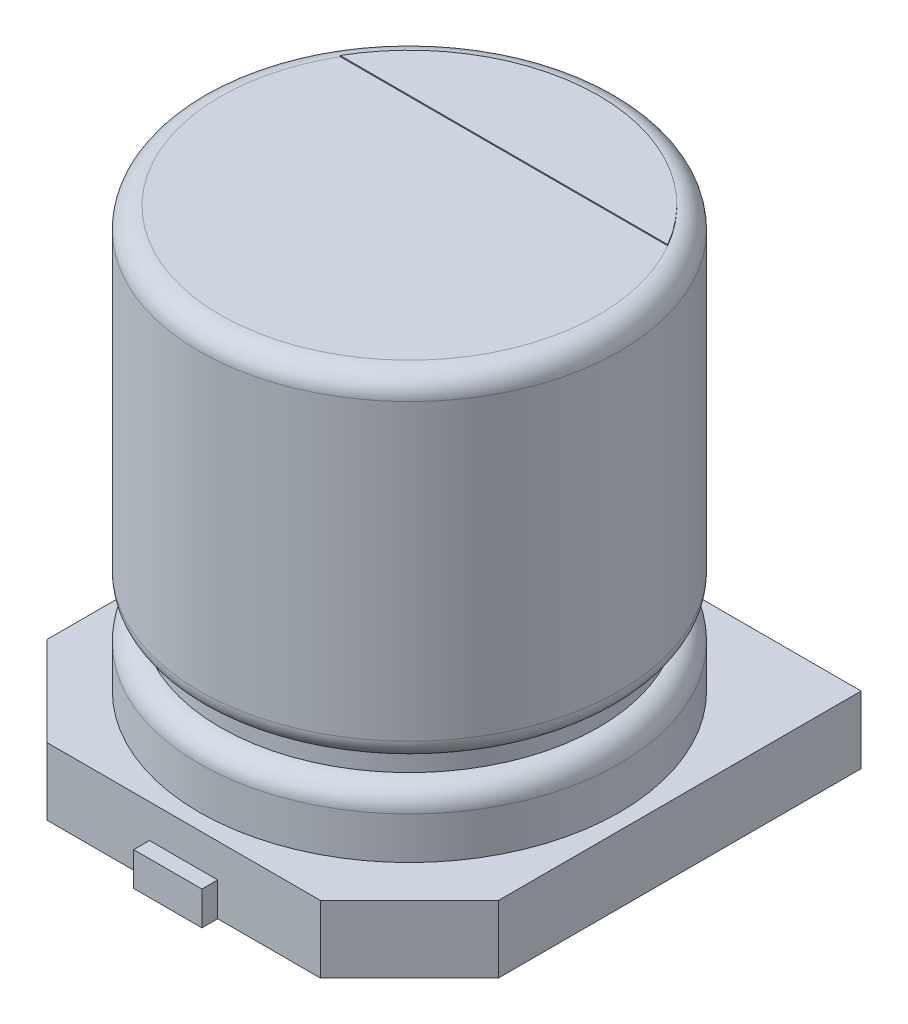
ISO-10303-21;
HEADER;
FILE_DESCRIPTION(('STEP AP214'),'2;1');
FILE_NAME('part.step','',(''),(''),'','','');
FILE_SCHEMA(('AUTOMOTIVE_DESIGN { 1 0 10303 214 1 1 1 1 }'));
ENDSEC;
DATA;
#1=APPLICATION_CONTEXT('core data for automotive mechanical design processes');
#2=APPLICATION_PROTOCOL_DEFINITION('international standard','automotive_design',2000,#1);
#3=PRODUCT_CONTEXT('',#1,'mechanical');
#4=PRODUCT('Part','Part','',(#3));
#5=PRODUCT_RELATED_PRODUCT_CATEGORY('part','',(#4));
#6=PRODUCT_DEFINITION_FORMATION('','',#4);
#7=PRODUCT_DEFINITION_CONTEXT('part definition',#1,'design');
#8=PRODUCT_DEFINITION('design','',#6,#7);
#9=PRODUCT_DEFINITION_SHAPE('','',#8);
#10=(LENGTH_UNIT() NAMED_UNIT(*) SI_UNIT(.MILLI.,.METRE.));
#11=(NAMED_UNIT(*) PLANE_ANGLE_UNIT() SI_UNIT($,.RADIAN.));
#12=(NAMED_UNIT(*) SI_UNIT($,.STERADIAN.) SOLID_ANGLE_UNIT());
#13=UNCERTAINTY_MEASURE_WITH_UNIT(LENGTH_MEASURE(1.E-05),#10,'distance_accuracy_value','');
#14=(GEOMETRIC_REPRESENTATION_CONTEXT(3) GLOBAL_UNCERTAINTY_ASSIGNED_CONTEXT((#13)) GLOBAL_UNIT_ASSIGNED_CONTEXT((#10,
#11,#12)) REPRESENTATION_CONTEXT('',''));
#15=CARTESIAN_POINT('',(0.,0.,0.));
#16=DIRECTION('',(0.,0.,1.));
#17=DIRECTION('',(1.,0.,0.));
#18=AXIS2_PLACEMENT_3D('',#15,#16,#17);
#19=CARTESIAN_POINT('',(0.,-0.64,0.));
#20=DIRECTION('',(0.,-1.,0.));
#21=DIRECTION('',(1.,0.,0.));
#22=AXIS2_PLACEMENT_3D('',#19,#20,#21);
#23=PLANE('',#22);
#24=DIRECTION('',(-1.,0.,0.));
#25=VECTOR('',#24,1.);
#26=CARTESIAN_POINT('',(1.30147186257614,-0.64,2.15));
#27=LINE('',#26,#25);
#28=CARTESIAN_POINT('',(1.30147186257614,-0.64,2.15));
#29=VERTEX_POINT('',#28);
#30=CARTESIAN_POINT('',(0.325,-0.64,2.15));
#31=VERTEX_POINT('',#30);
#32=EDGE_CURVE('E238',#29,#31,#27,.T.);
#33=ORIENTED_EDGE('',*,*,#32,.T.);
#34=DIRECTION('',(0.,0.,-1.));
#35=VECTOR('',#34,1.);
#36=CARTESIAN_POINT('',(0.325,-0.64,0.));
#37=LINE('',#36,#35);
#38=CARTESIAN_POINT('',(0.325,-0.64,0.5));
#39=VERTEX_POINT('',#38);
#40=EDGE_CURVE('E11',#31,#39,#37,.T.);
#41=ORIENTED_EDGE('',*,*,#40,.T.);
#42=DIRECTION('',(-1.,0.,0.));
#43=VECTOR('',#42,1.);
#44=CARTESIAN_POINT('',(0.,-0.64,0.5));
#45=LINE('',#44,#43);
#46=CARTESIAN_POINT('',(-0.325,-0.64,0.5));
#47=VERTEX_POINT('',#46);
#48=EDGE_CURVE('E45',#39,#47,#45,.T.);
#49=ORIENTED_EDGE('',*,*,#48,.T.);
#50=DIRECTION('',(0.,0.,1.));
#51=VECTOR('',#50,1.);
#52=CARTESIAN_POINT('',(-0.325,-0.64,0.));
#53=LINE('',#52,#51);
#54=CARTESIAN_POINT('',(-0.325,-0.64,2.15));
#55=VERTEX_POINT('',#54);
#56=EDGE_CURVE('E317',#47,#55,#53,.T.);
#57=ORIENTED_EDGE('',*,*,#56,.T.);
#58=CARTESIAN_POINT('',(-1.30147186257614,-0.64,2.15));
#59=VERTEX_POINT('',#58);
#60=EDGE_CURVE('E237',#55,#59,#27,.T.);
#61=ORIENTED_EDGE('',*,*,#60,.T.);
#62=DIRECTION('',(-0.707106781186546,0.,-0.707106781186549));
#63=VECTOR('',#62,1.);
#64=CARTESIAN_POINT('',(-1.30147186257614,-0.64,2.15));
#65=LINE('',#64,#63);
#66=CARTESIAN_POINT('',(-2.15,-0.64,1.30147186257614));
#67=VERTEX_POINT('',#66);
#68=EDGE_CURVE('E240',#59,#67,#65,.T.);
#69=ORIENTED_EDGE('',*,*,#68,.T.);
#70=DIRECTION('',(0.,0.,-1.));
#71=VECTOR('',#70,1.);
#72=CARTESIAN_POINT('',(-2.15,-0.64,1.30147186257614));
#73=LINE('',#72,#71);
#74=CARTESIAN_POINT('',(-2.15,-0.64,-2.15));
#75=VERTEX_POINT('',#74);
#76=EDGE_CURVE('E225',#67,#75,#73,.T.);
#77=ORIENTED_EDGE('',*,*,#76,.T.);
#78=DIRECTION('',(1.,0.,0.));
#79=VECTOR('',#78,1.);
#80=CARTESIAN_POINT('',(-2.15,-0.64,-2.15));
#81=LINE('',#80,#79);
#82=CARTESIAN_POINT('',(-0.325,-0.64,-2.15));
#83=VERTEX_POINT('',#82);
#84=EDGE_CURVE('E230',#75,#83,#81,.T.);
#85=ORIENTED_EDGE('',*,*,#84,.T.);
#86=DIRECTION('',(0.,0.,1.));
#87=VECTOR('',#86,1.);
#88=CARTESIAN_POINT('',(-0.325,-0.64,0.));
#89=LINE('',#88,#87);
#90=CARTESIAN_POINT('',(-0.325,-0.64,-0.5));
#91=VERTEX_POINT('',#90);
#92=EDGE_CURVE('E314',#83,#91,#89,.T.);
#93=ORIENTED_EDGE('',*,*,#92,.T.);
#94=DIRECTION('',(1.,0.,0.));
#95=VECTOR('',#94,1.);
#96=CARTESIAN_POINT('',(0.,-0.64,-0.5));
#97=LINE('',#96,#95);
#98=CARTESIAN_POINT('',(0.325,-0.64,-0.5));
#99=VERTEX_POINT('',#98);
#100=EDGE_CURVE('E307',#91,#99,#97,.T.);
#101=ORIENTED_EDGE('',*,*,#100,.T.);
#102=DIRECTION('',(0.,0.,-1.));
#103=VECTOR('',#102,1.);
#104=CARTESIAN_POINT('',(0.325,-0.64,0.));
#105=LINE('',#104,#103);
#106=CARTESIAN_POINT('',(0.325,-0.64,-2.15));
#107=VERTEX_POINT('',#106);
#108=EDGE_CURVE('E311',#99,#107,#105,.T.);
#109=ORIENTED_EDGE('',*,*,#108,.T.);
#110=CARTESIAN_POINT('',(2.15,-0.64,-2.15));
#111=VERTEX_POINT('',#110);
#112=EDGE_CURVE('E228',#107,#111,#81,.T.);
#113=ORIENTED_EDGE('',*,*,#112,.T.);
#114=DIRECTION('',(0.,0.,1.));
#115=VECTOR('',#114,1.);
#116=CARTESIAN_POINT('',(2.15,-0.64,-2.15));
#117=LINE('',#116,#115);
#118=CARTESIAN_POINT('',(2.15,-0.64,1.30147186257614));
#119=VERTEX_POINT('',#118);
#120=EDGE_CURVE('E233',#111,#119,#117,.T.);
#121=ORIENTED_EDGE('',*,*,#120,.T.);
#122=DIRECTION('',(-0.707106781186546,0.,0.707106781186549));
#123=VECTOR('',#122,1.);
#124=CARTESIAN_POINT('',(2.15,-0.64,1.30147186257614));
#125=LINE('',#124,#123);
#126=EDGE_CURVE('E235',#119,#29,#125,.T.);
#127=ORIENTED_EDGE('',*,*,#126,.T.);
#128=EDGE_LOOP('',(#33,#41,#49,#57,#61,#69,#77,#85,#93,#101,#109,#113,#121,#127));
#129=FACE_BOUND('',#128,.T.);
#130=ADVANCED_FACE('F36',(#129),#23,.T.);
#131=ORIENTED_EDGE('',*,*,#40,.F.);
#132=DIRECTION('',(0.,0.,1.));
#133=VECTOR('',#132,1.);
#134=CARTESIAN_POINT('',(0.325,-0.64,0.5));
#135=LINE('',#134,#133);
#136=CARTESIAN_POINT('',(0.325,-0.64,2.3));
#137=VERTEX_POINT('',#136);
#138=EDGE_CURVE('E156',#31,#137,#135,.T.);
#139=ORIENTED_EDGE('',*,*,#138,.T.);
#140=DIRECTION('',(-1.,0.,0.));
#141=VECTOR('',#140,1.);
#142=CARTESIAN_POINT('',(-0.325,-0.64,2.3));
#143=LINE('',#142,#141);
#144=CARTESIAN_POINT('',(-0.325,-0.64,2.3));
#145=VERTEX_POINT('',#144);
#146=EDGE_CURVE('E161',#137,#145,#143,.T.);
#147=ORIENTED_EDGE('',*,*,#146,.T.);
#148=DIRECTION('',(0.,0.,-1.));
#149=VECTOR('',#148,1.);
#150=CARTESIAN_POINT('',(-0.325,-0.64,0.5));
#151=LINE('',#150,#149);
#152=EDGE_CURVE('E180',#145,#55,#151,.T.);
#153=ORIENTED_EDGE('',*,*,#152,.T.);
#154=ORIENTED_EDGE('',*,*,#56,.F.);
#155=ORIENTED_EDGE('',*,*,#48,.F.);
#156=EDGE_LOOP('',(#131,#139,#147,#153,#154,#155));
#157=FACE_BOUND('',#156,.T.);
#158=ADVANCED_FACE('F158',(#157),#23,.T.);
#159=ORIENTED_EDGE('',*,*,#92,.F.);
#160=DIRECTION('',(0.,0.,-1.));
#161=VECTOR('',#160,1.);
#162=CARTESIAN_POINT('',(-0.325,-0.64,-0.5));
#163=LINE('',#162,#161);
#164=CARTESIAN_POINT('',(-0.325,-0.64,-2.3));
#165=VERTEX_POINT('',#164);
#166=EDGE_CURVE('E190',#83,#165,#163,.T.);
#167=ORIENTED_EDGE('',*,*,#166,.T.);
#168=DIRECTION('',(1.,0.,0.));
#169=VECTOR('',#168,1.);
#170=CARTESIAN_POINT('',(-0.325,-0.64,-2.3));
#171=LINE('',#170,#169);
#172=CARTESIAN_POINT('',(0.325,-0.64,-2.3));
#173=VERTEX_POINT('',#172);
#174=EDGE_CURVE('E192',#165,#173,#171,.T.);
#175=ORIENTED_EDGE('',*,*,#174,.T.);
#176=DIRECTION('',(0.,0.,1.));
#177=VECTOR('',#176,1.);
#178=CARTESIAN_POINT('',(0.325,-0.64,-0.5));
#179=LINE('',#178,#177);
#180=EDGE_CURVE('E195',#173,#107,#179,.T.);
#181=ORIENTED_EDGE('',*,*,#180,.T.);
#182=ORIENTED_EDGE('',*,*,#108,.F.);
#183=ORIENTED_EDGE('',*,*,#100,.F.);
#184=EDGE_LOOP('',(#159,#167,#175,#181,#182,#183));
#185=FACE_BOUND('',#184,.T.);
#186=ADVANCED_FACE('F372',(#185),#23,.T.);
#187=CARTESIAN_POINT('',(1.30147186257614,-0.64,2.15));
#188=DIRECTION('',(0.,0.,-1.));
#189=DIRECTION('',(-1.,0.,0.));
#190=AXIS2_PLACEMENT_3D('',#187,#188,#189);
#191=PLANE('',#190);
#192=DIRECTION('',(0.,-1.,0.));
#193=VECTOR('',#192,1.);
#194=CARTESIAN_POINT('',(-0.324999999999999,-0.32,2.15));
#195=LINE('',#194,#193);
#196=CARTESIAN_POINT('',(-0.325,-0.32,2.15));
#197=VERTEX_POINT('',#196);
#198=EDGE_CURVE('E212',#197,#55,#195,.T.);
#199=ORIENTED_EDGE('',*,*,#198,.F.);
#200=DIRECTION('',(-1.,0.,0.));
#201=VECTOR('',#200,1.);
#202=CARTESIAN_POINT('',(0.,-0.32,2.15));
#203=LINE('',#202,#201);
#204=CARTESIAN_POINT('',(0.325,-0.32,2.15));
#205=VERTEX_POINT('',#204);
#206=EDGE_CURVE('E209',#205,#197,#203,.T.);
#207=ORIENTED_EDGE('',*,*,#206,.F.);
#208=DIRECTION('',(0.,-1.,0.));
#209=VECTOR('',#208,1.);
#210=CARTESIAN_POINT('',(0.324999999999999,-0.32,2.15));
#211=LINE('',#210,#209);
#212=EDGE_CURVE('E211',#205,#31,#211,.T.);
#213=ORIENTED_EDGE('',*,*,#212,.T.);
#214=ORIENTED_EDGE('',*,*,#32,.F.);
#215=DIRECTION('',(0.,1.,0.));
#216=VECTOR('',#215,1.);
#217=CARTESIAN_POINT('',(1.30147186257614,-0.64,2.15));
#218=LINE('',#217,#216);
#219=CARTESIAN_POINT('',(1.30147186257614,0.,2.15));
#220=VERTEX_POINT('',#219);
#221=EDGE_CURVE('E259',#29,#220,#218,.T.);
#222=ORIENTED_EDGE('',*,*,#221,.T.);
#223=DIRECTION('',(-1.,0.,0.));
#224=VECTOR('',#223,1.);
#225=CARTESIAN_POINT('',(1.30147186257614,0.,2.15));
#226=LINE('',#225,#224);
#227=CARTESIAN_POINT('',(-1.30147186257614,0.,2.15));
#228=VERTEX_POINT('',#227);
#229=EDGE_CURVE('E251',#220,#228,#226,.T.);
#230=ORIENTED_EDGE('',*,*,#229,.T.);
#231=DIRECTION('',(0.,1.,0.));
#232=VECTOR('',#231,1.);
#233=CARTESIAN_POINT('',(-1.30147186257614,-0.64,2.15));
#234=LINE('',#233,#232);
#235=EDGE_CURVE('E256',#59,#228,#234,.T.);
#236=ORIENTED_EDGE('',*,*,#235,.F.);
#237=ORIENTED_EDGE('',*,*,#60,.F.);
#238=EDGE_LOOP('',(#199,#207,#213,#214,#222,#230,#236,#237));
#239=FACE_BOUND('',#238,.T.);
#240=ADVANCED_FACE('F340',(#239),#191,.F.);
#241=CARTESIAN_POINT('',(-2.15,-0.64,-2.15));
#242=DIRECTION('',(0.,0.,1.));
#243=DIRECTION('',(1.,0.,0.));
#244=AXIS2_PLACEMENT_3D('',#241,#242,#243);
#245=PLANE('',#244);
#246=DIRECTION('',(0.,-1.,0.));
#247=VECTOR('',#246,1.);
#248=CARTESIAN_POINT('',(0.324999999999999,-0.32,-2.15));
#249=LINE('',#248,#247);
#250=CARTESIAN_POINT('',(0.325,-0.32,-2.15));
#251=VERTEX_POINT('',#250);
#252=EDGE_CURVE('E219',#251,#107,#249,.T.);
#253=ORIENTED_EDGE('',*,*,#252,.F.);
#254=DIRECTION('',(1.,0.,0.));
#255=VECTOR('',#254,1.);
#256=CARTESIAN_POINT('',(0.,-0.32,-2.15));
#257=LINE('',#256,#255);
#258=CARTESIAN_POINT('',(-0.325,-0.32,-2.15));
#259=VERTEX_POINT('',#258);
#260=EDGE_CURVE('E215',#259,#251,#257,.T.);
#261=ORIENTED_EDGE('',*,*,#260,.F.);
#262=DIRECTION('',(0.,-1.,0.));
#263=VECTOR('',#262,1.);
#264=CARTESIAN_POINT('',(-0.324999999999999,-0.32,-2.15));
#265=LINE('',#264,#263);
#266=EDGE_CURVE('E218',#259,#83,#265,.T.);
#267=ORIENTED_EDGE('',*,*,#266,.T.);
#268=ORIENTED_EDGE('',*,*,#84,.F.);
#269=DIRECTION('',(0.,1.,0.));
#270=VECTOR('',#269,1.);
#271=CARTESIAN_POINT('',(-2.15,-0.64,-2.15));
#272=LINE('',#271,#270);
#273=CARTESIAN_POINT('',(-2.15,0.,-2.15));
#274=VERTEX_POINT('',#273);
#275=EDGE_CURVE('E268',#75,#274,#272,.T.);
#276=ORIENTED_EDGE('',*,*,#275,.T.);
#277=DIRECTION('',(1.,0.,0.));
#278=VECTOR('',#277,1.);
#279=CARTESIAN_POINT('',(-2.15,0.,-2.15));
#280=LINE('',#279,#278);
#281=CARTESIAN_POINT('',(2.15,0.,-2.15));
#282=VERTEX_POINT('',#281);
#283=EDGE_CURVE('E245',#274,#282,#280,.T.);
#284=ORIENTED_EDGE('',*,*,#283,.T.);
#285=DIRECTION('',(0.,1.,0.));
#286=VECTOR('',#285,1.);
#287=CARTESIAN_POINT('',(2.15,-0.64,-2.15));
#288=LINE('',#287,#286);
#289=EDGE_CURVE('E265',#111,#282,#288,.T.);
#290=ORIENTED_EDGE('',*,*,#289,.F.);
#291=ORIENTED_EDGE('',*,*,#112,.F.);
#292=EDGE_LOOP('',(#253,#261,#267,#268,#276,#284,#290,#291));
#293=FACE_BOUND('',#292,.T.);
#294=ADVANCED_FACE('F354',(#293),#245,.F.);
#295=CARTESIAN_POINT('',(0.,4.,0.));
#296=DIRECTION('',(0.,1.,0.));
#297=DIRECTION('',(-1.,0.,0.));
#298=AXIS2_PLACEMENT_3D('',#295,#296,#297);
#299=PLANE('',#298);
#300=CARTESIAN_POINT('',(0.,4.,0.));
#301=DIRECTION('',(0.,1.,0.));
#302=DIRECTION('',(-1.,0.,0.));
#303=AXIS2_PLACEMENT_3D('',#300,#301,#302);
#304=CIRCLE('',#303,1.8);
#305=CARTESIAN_POINT('',(-1.55884572681199,4.,-0.899999999999999));
#306=VERTEX_POINT('',#305);
#307=CARTESIAN_POINT('',(1.55884572681199,4.,-0.899999999999999));
#308=VERTEX_POINT('',#307);
#309=EDGE_CURVE('E303',#306,#308,#304,.T.);
#310=ORIENTED_EDGE('',*,*,#309,.T.);
#311=DIRECTION('',(1.,0.,0.));
#312=VECTOR('',#311,1.);
#313=CARTESIAN_POINT('',(-1.55884572681199,4.,-0.899999999999999));
#314=LINE('',#313,#312);
#315=EDGE_CURVE('E274',#306,#308,#314,.T.);
#316=ORIENTED_EDGE('',*,*,#315,.F.);
#317=EDGE_LOOP('',(#310,#316));
#318=FACE_BOUND('',#317,.T.);
#319=ADVANCED_FACE('F38',(#318),#299,.T.);
#320=CARTESIAN_POINT('',(0.,3.8,0.));
#321=DIRECTION('',(0.,1.,0.));
#322=DIRECTION('',(-1.,0.,0.));
#323=AXIS2_PLACEMENT_3D('',#320,#321,#322);
#324=TOROIDAL_SURFACE('',#323,1.8,0.2);
#325=CARTESIAN_POINT('',(0.,3.8,0.));
#326=DIRECTION('',(0.,1.,0.));
#327=DIRECTION('',(-1.,0.,0.));
#328=AXIS2_PLACEMENT_3D('',#325,#326,#327);
#329=CIRCLE('',#328,2.);
#330=CARTESIAN_POINT('',(-2.,3.8,0.));
#331=VERTEX_POINT('',#330);
#332=EDGE_CURVE('E300',#331,#331,#329,.T.);
#333=ORIENTED_EDGE('',*,*,#332,.T.);
#334=EDGE_LOOP('',(#333));
#335=FACE_BOUND('',#334,.T.);
#336=EDGE_CURVE('E304',#308,#306,#304,.T.);
#337=ORIENTED_EDGE('',*,*,#336,.F.);
#338=ORIENTED_EDGE('',*,*,#309,.F.);
#339=EDGE_LOOP('',(#337,#338));
#340=FACE_BOUND('',#339,.T.);
#341=ADVANCED_FACE('F453',(#335,#340),#324,.T.);
#342=CARTESIAN_POINT('',(0.,8.08222988146831,0.));
#343=DIRECTION('',(0.,1.,0.));
#344=DIRECTION('',(-1.,0.,0.));
#345=AXIS2_PLACEMENT_3D('',#342,#343,#344);
#346=CYLINDRICAL_SURFACE('',#345,2.);
#347=CARTESIAN_POINT('',(0.,0.999999999999999,0.));
#348=DIRECTION('',(0.,1.,0.));
#349=DIRECTION('',(-1.,0.,0.));
#350=AXIS2_PLACEMENT_3D('',#347,#348,#349);
#351=CIRCLE('',#350,2.);
#352=CARTESIAN_POINT('',(-2.,0.999999999999999,0.));
#353=VERTEX_POINT('',#352);
#354=EDGE_CURVE('E297',#353,#353,#351,.T.);
#355=ORIENTED_EDGE('',*,*,#354,.T.);
#356=EDGE_LOOP('',(#355));
#357=FACE_BOUND('',#356,.T.);
#358=ORIENTED_EDGE('',*,*,#332,.F.);
#359=EDGE_LOOP('',(#358));
#360=FACE_BOUND('',#359,.T.);
#361=ADVANCED_FACE('F450',(#357,#360),#346,.T.);
#362=CARTESIAN_POINT('',(0.,1.,0.));
#363=DIRECTION('',(0.,1.,0.));
#364=DIRECTION('',(-1.,0.,0.));
#365=AXIS2_PLACEMENT_3D('',#362,#363,#364);
#366=TOROIDAL_SURFACE('',#365,1.8,0.2);
#367=CARTESIAN_POINT('',(0.,0.799999999999999,0.));
#368=DIRECTION('',(0.,1.,0.));
#369=DIRECTION('',(-1.,0.,0.));
#370=AXIS2_PLACEMENT_3D('',#367,#368,#369);
#371=CIRCLE('',#370,1.8);
#372=CARTESIAN_POINT('',(-1.8,0.799999999999999,0.));
#373=VERTEX_POINT('',#372);
#374=EDGE_CURVE('E294',#373,#373,#371,.T.);
#375=ORIENTED_EDGE('',*,*,#374,.T.);
#376=EDGE_LOOP('',(#375));
#377=FACE_BOUND('',#376,.T.);
#378=ORIENTED_EDGE('',*,*,#354,.F.);
#379=EDGE_LOOP('',(#378));
#380=FACE_BOUND('',#379,.T.);
#381=ADVANCED_FACE('F446',(#377,#380),#366,.T.);
#382=CARTESIAN_POINT('',(0.,8.08222988146831,0.));
#383=DIRECTION('',(0.,1.,0.));
#384=DIRECTION('',(-1.,0.,0.));
#385=AXIS2_PLACEMENT_3D('',#382,#383,#384);
#386=CYLINDRICAL_SURFACE('',#385,1.8);
#387=CARTESIAN_POINT('',(0.,0.6,0.));
#388=DIRECTION('',(0.,1.,0.));
#389=DIRECTION('',(-1.,0.,0.));
#390=AXIS2_PLACEMENT_3D('',#387,#388,#389);
#391=CIRCLE('',#390,1.8);
#392=CARTESIAN_POINT('',(-1.8,0.6,0.));
#393=VERTEX_POINT('',#392);
#394=EDGE_CURVE('E291',#393,#393,#391,.T.);
#395=ORIENTED_EDGE('',*,*,#394,.T.);
#396=EDGE_LOOP('',(#395));
#397=FACE_BOUND('',#396,.T.);
#398=ORIENTED_EDGE('',*,*,#374,.F.);
#399=EDGE_LOOP('',(#398));
#400=FACE_BOUND('',#399,.T.);
#401=ADVANCED_FACE('F442',(#397,#400),#386,.T.);
#402=CARTESIAN_POINT('',(0.,0.4,0.));
#403=DIRECTION('',(0.,1.,0.));
#404=DIRECTION('',(-1.,0.,0.));
#405=AXIS2_PLACEMENT_3D('',#402,#403,#404);
#406=TOROIDAL_SURFACE('',#405,1.8,0.2);
#407=CARTESIAN_POINT('',(0.,0.399999999999999,0.));
#408=DIRECTION('',(0.,1.,0.));
#409=DIRECTION('',(-1.,0.,0.));
#410=AXIS2_PLACEMENT_3D('',#407,#408,#409);
#411=CIRCLE('',#410,2.);
#412=CARTESIAN_POINT('',(-2.,0.399999999999999,0.));
#413=VERTEX_POINT('',#412);
#414=EDGE_CURVE('E288',#413,#413,#411,.T.);
#415=ORIENTED_EDGE('',*,*,#414,.T.);
#416=EDGE_LOOP('',(#415));
#417=FACE_BOUND('',#416,.T.);
#418=ORIENTED_EDGE('',*,*,#394,.F.);
#419=EDGE_LOOP('',(#418));
#420=FACE_BOUND('',#419,.T.);
#421=ADVANCED_FACE('F438',(#417,#420),#406,.T.);
#422=CARTESIAN_POINT('',(0.,8.08222988146831,0.));
#423=DIRECTION('',(0.,1.,0.));
#424=DIRECTION('',(-1.,0.,0.));
#425=AXIS2_PLACEMENT_3D('',#422,#423,#424);
#426=CYLINDRICAL_SURFACE('',#425,2.);
#427=CARTESIAN_POINT('',(0.,0.,0.));
#428=DIRECTION('',(0.,-1.,0.));
#429=DIRECTION('',(1.,0.,0.));
#430=AXIS2_PLACEMENT_3D('',#427,#428,#429);
#431=CIRCLE('',#430,2.);
#432=CARTESIAN_POINT('',(2.,0.,0.));
#433=VERTEX_POINT('',#432);
#434=EDGE_CURVE('E271',#433,#433,#431,.F.);
#435=ORIENTED_EDGE('',*,*,#434,.T.);
#436=EDGE_LOOP('',(#435));
#437=FACE_BOUND('',#436,.T.);
#438=ORIENTED_EDGE('',*,*,#414,.F.);
#439=EDGE_LOOP('',(#438));
#440=FACE_BOUND('',#439,.T.);
#441=ADVANCED_FACE('F434',(#437,#440),#426,.T.);
#442=CARTESIAN_POINT('',(0.,4.01,0.));
#443=DIRECTION('',(0.,-1.,0.));
#444=DIRECTION('',(1.,0.,0.));
#445=AXIS2_PLACEMENT_3D('',#442,#443,#444);
#446=CYLINDRICAL_SURFACE('',#445,1.8);
#447=ORIENTED_EDGE('',*,*,#336,.T.);
#448=DIRECTION('',(0.,-1.,0.));
#449=VECTOR('',#448,1.);
#450=CARTESIAN_POINT('',(-1.55884572681199,4.01,-0.899999999999999));
#451=LINE('',#450,#449);
#452=CARTESIAN_POINT('',(-1.55884572681199,4.01,-0.899999999999999));
#453=VERTEX_POINT('',#452);
#454=EDGE_CURVE('E285',#453,#306,#451,.T.);
#455=ORIENTED_EDGE('',*,*,#454,.F.);
#456=CARTESIAN_POINT('',(0.,4.01,0.));
#457=DIRECTION('',(0.,1.,0.));
#458=DIRECTION('',(-1.,0.,0.));
#459=AXIS2_PLACEMENT_3D('',#456,#457,#458);
#460=CIRCLE('',#459,1.8);
#461=CARTESIAN_POINT('',(1.55884572681199,4.01,-0.899999999999999));
#462=VERTEX_POINT('',#461);
#463=EDGE_CURVE('E275',#462,#453,#460,.T.);
#464=ORIENTED_EDGE('',*,*,#463,.F.);
#465=DIRECTION('',(0.,-1.,0.));
#466=VECTOR('',#465,1.);
#467=CARTESIAN_POINT('',(1.55884572681199,4.01,-0.899999999999999));
#468=LINE('',#467,#466);
#469=EDGE_CURVE('E280',#462,#308,#468,.T.);
#470=ORIENTED_EDGE('',*,*,#469,.T.);
#471=EDGE_LOOP('',(#447,#455,#464,#470));
#472=FACE_BOUND('',#471,.T.);
#473=ADVANCED_FACE('F430',(#472),#446,.T.);
#474=CARTESIAN_POINT('',(-1.55884572681199,4.01,-0.899999999999999));
#475=DIRECTION('',(0.,0.,-1.));
#476=DIRECTION('',(-1.,0.,0.));
#477=AXIS2_PLACEMENT_3D('',#474,#475,#476);
#478=PLANE('',#477);
#479=ORIENTED_EDGE('',*,*,#315,.T.);
#480=ORIENTED_EDGE('',*,*,#469,.F.);
#481=DIRECTION('',(1.,0.,0.));
#482=VECTOR('',#481,1.);
#483=CARTESIAN_POINT('',(-1.55884572681199,4.01,-0.899999999999999));
#484=LINE('',#483,#482);
#485=EDGE_CURVE('E278',#453,#462,#484,.T.);
#486=ORIENTED_EDGE('',*,*,#485,.F.);
#487=ORIENTED_EDGE('',*,*,#454,.T.);
#488=EDGE_LOOP('',(#479,#480,#486,#487));
#489=FACE_BOUND('',#488,.T.);
#490=ADVANCED_FACE('F426',(#489),#478,.F.);
#491=CARTESIAN_POINT('',(0.,4.01,0.));
#492=DIRECTION('',(0.,1.,0.));
#493=DIRECTION('',(-1.,0.,0.));
#494=AXIS2_PLACEMENT_3D('',#491,#492,#493);
#495=PLANE('',#494);
#496=ORIENTED_EDGE('',*,*,#463,.T.);
#497=ORIENTED_EDGE('',*,*,#485,.T.);
#498=EDGE_LOOP('',(#496,#497));
#499=FACE_BOUND('',#498,.T.);
#500=ADVANCED_FACE('F423',(#499),#495,.T.);
#501=CARTESIAN_POINT('',(-2.15,-0.64,1.30147186257614));
#502=DIRECTION('',(1.,0.,0.));
#503=DIRECTION('',(0.,1.,0.));
#504=AXIS2_PLACEMENT_3D('',#501,#502,#503);
#505=PLANE('',#504);
#506=DIRECTION('',(0.,0.,-1.));
#507=VECTOR('',#506,1.);
#508=CARTESIAN_POINT('',(-2.15,0.,1.30147186257614));
#509=LINE('',#508,#507);
#510=CARTESIAN_POINT('',(-2.15,0.,1.30147186257614));
#511=VERTEX_POINT('',#510);
#512=EDGE_CURVE('E222',#511,#274,#509,.T.);
#513=ORIENTED_EDGE('',*,*,#512,.T.);
#514=ORIENTED_EDGE('',*,*,#275,.F.);
#515=ORIENTED_EDGE('',*,*,#76,.F.);
#516=DIRECTION('',(0.,1.,0.));
#517=VECTOR('',#516,1.);
#518=CARTESIAN_POINT('',(-2.15,-0.64,1.30147186257614));
#519=LINE('',#518,#517);
#520=EDGE_CURVE('E242',#67,#511,#519,.T.);
#521=ORIENTED_EDGE('',*,*,#520,.T.);
#522=EDGE_LOOP('',(#513,#514,#515,#521));
#523=FACE_BOUND('',#522,.T.);
#524=ADVANCED_FACE('F350',(#523),#505,.F.);
#525=CARTESIAN_POINT('',(2.15,-0.64,-2.15));
#526=DIRECTION('',(-1.,0.,0.));
#527=DIRECTION('',(0.,-1.,0.));
#528=AXIS2_PLACEMENT_3D('',#525,#526,#527);
#529=PLANE('',#528);
#530=DIRECTION('',(0.,0.,1.));
#531=VECTOR('',#530,1.);
#532=CARTESIAN_POINT('',(2.15,0.,-2.15));
#533=LINE('',#532,#531);
#534=CARTESIAN_POINT('',(2.15,0.,1.30147186257614));
#535=VERTEX_POINT('',#534);
#536=EDGE_CURVE('E247',#282,#535,#533,.T.);
#537=ORIENTED_EDGE('',*,*,#536,.T.);
#538=DIRECTION('',(0.,1.,0.));
#539=VECTOR('',#538,1.);
#540=CARTESIAN_POINT('',(2.15,-0.64,1.30147186257614));
#541=LINE('',#540,#539);
#542=EDGE_CURVE('E262',#119,#535,#541,.T.);
#543=ORIENTED_EDGE('',*,*,#542,.F.);
#544=ORIENTED_EDGE('',*,*,#120,.F.);
#545=ORIENTED_EDGE('',*,*,#289,.T.);
#546=EDGE_LOOP('',(#537,#543,#544,#545));
#547=FACE_BOUND('',#546,.T.);
#548=ADVANCED_FACE('F381',(#547),#529,.F.);
#549=CARTESIAN_POINT('',(2.15,-0.64,1.30147186257614));
#550=DIRECTION('',(-0.707106781186549,0.,-0.707106781186546));
#551=DIRECTION('',(-0.707106781186546,0.,0.707106781186549));
#552=AXIS2_PLACEMENT_3D('',#549,#550,#551);
#553=PLANE('',#552);
#554=DIRECTION('',(-0.707106781186546,0.,0.707106781186549));
#555=VECTOR('',#554,1.);
#556=CARTESIAN_POINT('',(2.15,0.,1.30147186257614));
#557=LINE('',#556,#555);
#558=EDGE_CURVE('E249',#535,#220,#557,.T.);
#559=ORIENTED_EDGE('',*,*,#558,.T.);
#560=ORIENTED_EDGE('',*,*,#221,.F.);
#561=ORIENTED_EDGE('',*,*,#126,.F.);
#562=ORIENTED_EDGE('',*,*,#542,.T.);
#563=EDGE_LOOP('',(#559,#560,#561,#562));
#564=FACE_BOUND('',#563,.T.);
#565=ADVANCED_FACE('F386',(#564),#553,.F.);
#566=CARTESIAN_POINT('',(-1.30147186257614,-0.64,2.15));
#567=DIRECTION('',(0.707106781186549,0.,-0.707106781186546));
#568=DIRECTION('',(-0.707106781186546,0.,-0.707106781186549));
#569=AXIS2_PLACEMENT_3D('',#566,#567,#568);
#570=PLANE('',#569);
#571=DIRECTION('',(-0.707106781186546,0.,-0.707106781186549));
#572=VECTOR('',#571,1.);
#573=CARTESIAN_POINT('',(-1.30147186257614,0.,2.15));
#574=LINE('',#573,#572);
#575=EDGE_CURVE('E229',#228,#511,#574,.T.);
#576=ORIENTED_EDGE('',*,*,#575,.T.);
#577=ORIENTED_EDGE('',*,*,#520,.F.);
#578=ORIENTED_EDGE('',*,*,#68,.F.);
#579=ORIENTED_EDGE('',*,*,#235,.T.);
#580=EDGE_LOOP('',(#576,#577,#578,#579));
#581=FACE_BOUND('',#580,.T.);
#582=ADVANCED_FACE('F346',(#581),#570,.F.);
#583=CARTESIAN_POINT('',(0.,0.,0.));
#584=DIRECTION('',(0.,-1.,0.));
#585=DIRECTION('',(1.,0.,0.));
#586=AXIS2_PLACEMENT_3D('',#583,#584,#585);
#587=PLANE('',#586);
#588=ORIENTED_EDGE('',*,*,#434,.F.);
#589=EDGE_LOOP('',(#588));
#590=FACE_BOUND('',#589,.T.);
#591=ORIENTED_EDGE('',*,*,#512,.F.);
#592=ORIENTED_EDGE('',*,*,#575,.F.);
#593=ORIENTED_EDGE('',*,*,#229,.F.);
#594=ORIENTED_EDGE('',*,*,#558,.F.);
#595=ORIENTED_EDGE('',*,*,#536,.F.);
#596=ORIENTED_EDGE('',*,*,#283,.F.);
#597=EDGE_LOOP('',(#591,#592,#593,#594,#595,#596));
#598=FACE_BOUND('',#597,.T.);
#599=ADVANCED_FACE('F489',(#590,#598),#587,.F.);
#600=CARTESIAN_POINT('',(0.,-0.32,0.));
#601=DIRECTION('',(0.,-1.,0.));
#602=DIRECTION('',(0.,0.,-1.));
#603=AXIS2_PLACEMENT_3D('',#600,#601,#602);
#604=PLANE('',#603);
#605=DIRECTION('',(0.,0.,-1.));
#606=VECTOR('',#605,1.);
#607=CARTESIAN_POINT('',(-0.325,-0.32,-0.5));
#608=LINE('',#607,#606);
#609=CARTESIAN_POINT('',(-0.325,-0.32,-2.3));
#610=VERTEX_POINT('',#609);
#611=EDGE_CURVE('E174',#259,#610,#608,.T.);
#612=ORIENTED_EDGE('',*,*,#611,.F.);
#613=ORIENTED_EDGE('',*,*,#260,.T.);
#614=DIRECTION('',(0.,0.,1.));
#615=VECTOR('',#614,1.);
#616=CARTESIAN_POINT('',(0.325,-0.32,-0.5));
#617=LINE('',#616,#615);
#618=CARTESIAN_POINT('',(0.325,-0.32,-2.3));
#619=VERTEX_POINT('',#618);
#620=EDGE_CURVE('E193',#619,#251,#617,.T.);
#621=ORIENTED_EDGE('',*,*,#620,.F.);
#622=DIRECTION('',(1.,0.,0.));
#623=VECTOR('',#622,1.);
#624=CARTESIAN_POINT('',(-0.325,-0.32,-2.3));
#625=LINE('',#624,#623);
#626=EDGE_CURVE('E200',#610,#619,#625,.T.);
#627=ORIENTED_EDGE('',*,*,#626,.F.);
#628=EDGE_LOOP('',(#612,#613,#621,#627));
#629=FACE_BOUND('',#628,.T.);
#630=ADVANCED_FACE('F364',(#629),#604,.F.);
#631=CARTESIAN_POINT('',(-0.325,-0.64,-0.5));
#632=DIRECTION('',(1.,0.,0.));
#633=DIRECTION('',(0.,0.,-1.));
#634=AXIS2_PLACEMENT_3D('',#631,#632,#633);
#635=PLANE('',#634);
#636=ORIENTED_EDGE('',*,*,#166,.F.);
#637=ORIENTED_EDGE('',*,*,#266,.F.);
#638=ORIENTED_EDGE('',*,*,#611,.T.);
#639=DIRECTION('',(0.,1.,0.));
#640=VECTOR('',#639,1.);
#641=CARTESIAN_POINT('',(-0.325,-0.64,-2.3));
#642=LINE('',#641,#640);
#643=EDGE_CURVE('E206',#165,#610,#642,.T.);
#644=ORIENTED_EDGE('',*,*,#643,.F.);
#645=EDGE_LOOP('',(#636,#637,#638,#644));
#646=FACE_BOUND('',#645,.T.);
#647=ADVANCED_FACE('F360',(#646),#635,.F.);
#648=CARTESIAN_POINT('',(0.325,-0.64,-0.5));
#649=DIRECTION('',(-1.,0.,0.));
#650=DIRECTION('',(0.,0.,1.));
#651=AXIS2_PLACEMENT_3D('',#648,#649,#650);
#652=PLANE('',#651);
#653=ORIENTED_EDGE('',*,*,#620,.T.);
#654=ORIENTED_EDGE('',*,*,#252,.T.);
#655=ORIENTED_EDGE('',*,*,#180,.F.);
#656=DIRECTION('',(0.,1.,0.));
#657=VECTOR('',#656,1.);
#658=CARTESIAN_POINT('',(0.325,-0.64,-2.3));
#659=LINE('',#658,#657);
#660=EDGE_CURVE('E198',#173,#619,#659,.T.);
#661=ORIENTED_EDGE('',*,*,#660,.T.);
#662=EDGE_LOOP('',(#653,#654,#655,#661));
#663=FACE_BOUND('',#662,.T.);
#664=ADVANCED_FACE('F376',(#663),#652,.F.);
#665=CARTESIAN_POINT('',(-0.325,-0.64,-2.3));
#666=DIRECTION('',(0.,0.,1.));
#667=DIRECTION('',(0.,-1.,0.));
#668=AXIS2_PLACEMENT_3D('',#665,#666,#667);
#669=PLANE('',#668);
#670=ORIENTED_EDGE('',*,*,#626,.T.);
#671=ORIENTED_EDGE('',*,*,#660,.F.);
#672=ORIENTED_EDGE('',*,*,#174,.F.);
#673=ORIENTED_EDGE('',*,*,#643,.T.);
#674=EDGE_LOOP('',(#670,#671,#672,#673));
#675=FACE_BOUND('',#674,.T.);
#676=ADVANCED_FACE('F369',(#675),#669,.F.);
#677=CARTESIAN_POINT('',(0.,-0.32,0.));
#678=DIRECTION('',(0.,-1.,0.));
#679=DIRECTION('',(0.,0.,-1.));
#680=AXIS2_PLACEMENT_3D('',#677,#678,#679);
#681=PLANE('',#680);
#682=DIRECTION('',(0.,0.,1.));
#683=VECTOR('',#682,1.);
#684=CARTESIAN_POINT('',(0.325,-0.32,0.5));
#685=LINE('',#684,#683);
#686=CARTESIAN_POINT('',(0.325,-0.32,2.3));
#687=VERTEX_POINT('',#686);
#688=EDGE_CURVE('E171',#205,#687,#685,.T.);
#689=ORIENTED_EDGE('',*,*,#688,.F.);
#690=ORIENTED_EDGE('',*,*,#206,.T.);
#691=DIRECTION('',(0.,0.,-1.));
#692=VECTOR('',#691,1.);
#693=CARTESIAN_POINT('',(-0.325,-0.32,0.5));
#694=LINE('',#693,#692);
#695=CARTESIAN_POINT('',(-0.325,-0.32,2.3));
#696=VERTEX_POINT('',#695);
#697=EDGE_CURVE('E165',#696,#197,#694,.T.);
#698=ORIENTED_EDGE('',*,*,#697,.F.);
#699=DIRECTION('',(-1.,0.,0.));
#700=VECTOR('',#699,1.);
#701=CARTESIAN_POINT('',(-0.325,-0.32,2.3));
#702=LINE('',#701,#700);
#703=EDGE_CURVE('E185',#687,#696,#702,.T.);
#704=ORIENTED_EDGE('',*,*,#703,.F.);
#705=EDGE_LOOP('',(#689,#690,#698,#704));
#706=FACE_BOUND('',#705,.T.);
#707=ADVANCED_FACE('F389',(#706),#681,.F.);
#708=CARTESIAN_POINT('',(0.325,-0.64,0.5));
#709=DIRECTION('',(-1.,0.,0.));
#710=DIRECTION('',(0.,0.,1.));
#711=AXIS2_PLACEMENT_3D('',#708,#709,#710);
#712=PLANE('',#711);
#713=ORIENTED_EDGE('',*,*,#138,.F.);
#714=ORIENTED_EDGE('',*,*,#212,.F.);
#715=ORIENTED_EDGE('',*,*,#688,.T.);
#716=DIRECTION('',(0.,1.,0.));
#717=VECTOR('',#716,1.);
#718=CARTESIAN_POINT('',(0.325,-0.64,2.3));
#719=LINE('',#718,#717);
#720=EDGE_CURVE('E168',#137,#687,#719,.T.);
#721=ORIENTED_EDGE('',*,*,#720,.F.);
#722=EDGE_LOOP('',(#713,#714,#715,#721));
#723=FACE_BOUND('',#722,.T.);
#724=ADVANCED_FACE('F169',(#723),#712,.F.);
#725=CARTESIAN_POINT('',(-0.325,-0.64,0.5));
#726=DIRECTION('',(1.,0.,0.));
#727=DIRECTION('',(0.,0.,-1.));
#728=AXIS2_PLACEMENT_3D('',#725,#726,#727);
#729=PLANE('',#728);
#730=ORIENTED_EDGE('',*,*,#697,.T.);
#731=ORIENTED_EDGE('',*,*,#198,.T.);
#732=ORIENTED_EDGE('',*,*,#152,.F.);
#733=DIRECTION('',(0.,1.,0.));
#734=VECTOR('',#733,1.);
#735=CARTESIAN_POINT('',(-0.325,-0.64,2.3));
#736=LINE('',#735,#734);
#737=EDGE_CURVE('E175',#145,#696,#736,.T.);
#738=ORIENTED_EDGE('',*,*,#737,.T.);
#739=EDGE_LOOP('',(#730,#731,#732,#738));
#740=FACE_BOUND('',#739,.T.);
#741=ADVANCED_FACE('F336',(#740),#729,.F.);
#742=CARTESIAN_POINT('',(-0.325,-0.64,2.3));
#743=DIRECTION('',(0.,0.,-1.));
#744=DIRECTION('',(0.,1.,0.));
#745=AXIS2_PLACEMENT_3D('',#742,#743,#744);
#746=PLANE('',#745);
#747=ORIENTED_EDGE('',*,*,#703,.T.);
#748=ORIENTED_EDGE('',*,*,#737,.F.);
#749=ORIENTED_EDGE('',*,*,#146,.F.);
#750=ORIENTED_EDGE('',*,*,#720,.T.);
#751=EDGE_LOOP('',(#747,#748,#749,#750));
#752=FACE_BOUND('',#751,.T.);
#753=ADVANCED_FACE('F177',(#752),#746,.F.);
#754=CLOSED_SHELL('',(#130,#158,#186,#240,#294,#319,#341,#361,#381,#401,#421,#441,#473,#490,
#500,#524,#548,#565,#582,#599,#630,#647,#664,#676,#707,#724,#741,#753));
#755=MANIFOLD_SOLID_BREP('B2',#754);
#756=ADVANCED_BREP_SHAPE_REPRESENTATION('',(#18,#755),#14);
#757=SHAPE_DEFINITION_REPRESENTATION(#9,#756);
ENDSEC;
END-ISO-10303-21;
